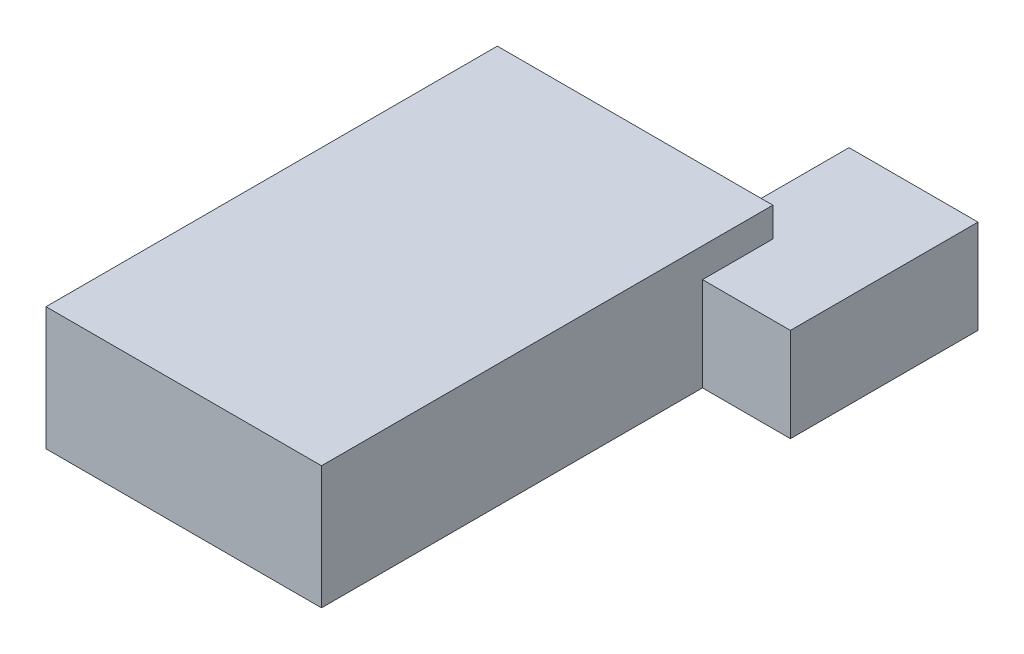
ISO-10303-21;
HEADER;
FILE_DESCRIPTION(('STEP AP214'),'2;1');
FILE_NAME('part.step','',(''),(''),'','','');
FILE_SCHEMA(('AUTOMOTIVE_DESIGN { 1 0 10303 214 1 1 1 1 }'));
ENDSEC;
DATA;
#1=APPLICATION_CONTEXT('core data for automotive mechanical design processes');
#2=APPLICATION_PROTOCOL_DEFINITION('international standard','automotive_design',2000,#1);
#3=PRODUCT_CONTEXT('',#1,'mechanical');
#4=PRODUCT('Part','Part','',(#3));
#5=PRODUCT_RELATED_PRODUCT_CATEGORY('part','',(#4));
#6=PRODUCT_DEFINITION_FORMATION('','',#4);
#7=PRODUCT_DEFINITION_CONTEXT('part definition',#1,'design');
#8=PRODUCT_DEFINITION('design','',#6,#7);
#9=PRODUCT_DEFINITION_SHAPE('','',#8);
#10=(LENGTH_UNIT() NAMED_UNIT(*) SI_UNIT(.MILLI.,.METRE.));
#11=(NAMED_UNIT(*) PLANE_ANGLE_UNIT() SI_UNIT($,.RADIAN.));
#12=(NAMED_UNIT(*) SI_UNIT($,.STERADIAN.) SOLID_ANGLE_UNIT());
#13=UNCERTAINTY_MEASURE_WITH_UNIT(LENGTH_MEASURE(1.E-05),#10,'distance_accuracy_value','');
#14=(GEOMETRIC_REPRESENTATION_CONTEXT(3) GLOBAL_UNCERTAINTY_ASSIGNED_CONTEXT((#13)) GLOBAL_UNIT_ASSIGNED_CONTEXT((#10,
#11,#12)) REPRESENTATION_CONTEXT('',''));
#15=CARTESIAN_POINT('',(0.,0.,0.));
#16=DIRECTION('',(0.,0.,1.));
#17=DIRECTION('',(1.,0.,0.));
#18=AXIS2_PLACEMENT_3D('',#15,#16,#17);
#19=CARTESIAN_POINT('',(4.44089209850063E-13,3000.,-5500.));
#20=DIRECTION('',(0.,1.,0.));
#21=DIRECTION('',(-1.,0.,0.));
#22=AXIS2_PLACEMENT_3D('',#19,#20,#21);
#23=PLANE('',#22);
#24=DIRECTION('',(1.,0.,0.));
#25=VECTOR('',#24,1.);
#26=CARTESIAN_POINT('',(4.44089209850063E-13,3000.,-5500.));
#27=LINE('',#26,#25);
#28=CARTESIAN_POINT('',(4700.,3000.,-5500.));
#29=VERTEX_POINT('',#28);
#30=CARTESIAN_POINT('',(7500.,3000.,-5500.));
#31=VERTEX_POINT('',#30);
#32=EDGE_CURVE('E250',#29,#31,#27,.T.);
#33=ORIENTED_EDGE('',*,*,#32,.F.);
#34=DIRECTION('',(0.,0.,-1.));
#35=VECTOR('',#34,1.);
#36=CARTESIAN_POINT('',(4700.00000000003,3000.,-2.08721928629531E-11));
#37=LINE('',#36,#35);
#38=CARTESIAN_POINT('',(4700.,3000.,-7700.));
#39=VERTEX_POINT('',#38);
#40=EDGE_CURVE('E62',#29,#39,#37,.T.);
#41=ORIENTED_EDGE('',*,*,#40,.T.);
#42=DIRECTION('',(-1.,0.,0.));
#43=VECTOR('',#42,1.);
#44=CARTESIAN_POINT('',(4.75041074259391E-13,3000.,-7700.));
#45=LINE('',#44,#43);
#46=CARTESIAN_POINT('',(3500.,3000.,-7700.));
#47=VERTEX_POINT('',#46);
#48=EDGE_CURVE('E222',#39,#47,#45,.T.);
#49=ORIENTED_EDGE('',*,*,#48,.T.);
#50=DIRECTION('',(0.,0.,-1.));
#51=VECTOR('',#50,1.);
#52=CARTESIAN_POINT('',(3500.,3000.,-5500.));
#53=LINE('',#52,#51);
#54=CARTESIAN_POINT('',(3500.,3000.,-11500.));
#55=VERTEX_POINT('',#54);
#56=EDGE_CURVE('E258',#47,#55,#53,.T.);
#57=ORIENTED_EDGE('',*,*,#56,.T.);
#58=DIRECTION('',(1.,0.,0.));
#59=VECTOR('',#58,1.);
#60=CARTESIAN_POINT('',(4.44089209850063E-13,3000.,-11500.));
#61=LINE('',#60,#59);
#62=CARTESIAN_POINT('',(7500.,3000.,-11500.));
#63=VERTEX_POINT('',#62);
#64=EDGE_CURVE('E241',#55,#63,#61,.T.);
#65=ORIENTED_EDGE('',*,*,#64,.T.);
#66=DIRECTION('',(0.,0.,-1.));
#67=VECTOR('',#66,1.);
#68=CARTESIAN_POINT('',(7500.,3000.,-5500.));
#69=LINE('',#68,#67);
#70=EDGE_CURVE('E257',#31,#63,#69,.T.);
#71=ORIENTED_EDGE('',*,*,#70,.F.);
#72=EDGE_LOOP('',(#33,#41,#49,#57,#65,#71));
#73=FACE_BOUND('',#72,.T.);
#74=ADVANCED_FACE('F37',(#73),#23,.F.);
#75=CARTESIAN_POINT('',(0.,0.,-5500.));
#76=DIRECTION('',(0.,0.,-1.));
#77=DIRECTION('',(-1.,0.,0.));
#78=AXIS2_PLACEMENT_3D('',#75,#76,#77);
#79=PLANE('',#78);
#80=DIRECTION('',(1.,0.,0.));
#81=VECTOR('',#80,1.);
#82=CARTESIAN_POINT('',(0.,0.,-5500.));
#83=LINE('',#82,#81);
#84=CARTESIAN_POINT('',(4700.,-5.75583995599256E-13,-5500.));
#85=VERTEX_POINT('',#84);
#86=CARTESIAN_POINT('',(7500.,0.,-5500.));
#87=VERTEX_POINT('',#86);
#88=EDGE_CURVE('E255',#85,#87,#83,.T.);
#89=ORIENTED_EDGE('',*,*,#88,.F.);
#90=DIRECTION('',(0.,1.,0.));
#91=VECTOR('',#90,1.);
#92=CARTESIAN_POINT('',(4700.,-1264.91106406735,-5500.));
#93=LINE('',#92,#91);
#94=EDGE_CURVE('E672',#85,#29,#93,.T.);
#95=ORIENTED_EDGE('',*,*,#94,.T.);
#96=ORIENTED_EDGE('',*,*,#32,.T.);
#97=DIRECTION('',(0.,-1.,0.));
#98=VECTOR('',#97,1.);
#99=CARTESIAN_POINT('',(7500.,0.,-5500.));
#100=LINE('',#99,#98);
#101=EDGE_CURVE('E252',#31,#87,#100,.T.);
#102=ORIENTED_EDGE('',*,*,#101,.T.);
#103=EDGE_LOOP('',(#89,#95,#96,#102));
#104=FACE_BOUND('',#103,.T.);
#105=ADVANCED_FACE('F403',(#104),#79,.T.);
#106=CARTESIAN_POINT('',(0.,0.,0.));
#107=DIRECTION('',(0.,-1.,0.));
#108=DIRECTION('',(0.,0.,-1.));
#109=AXIS2_PLACEMENT_3D('',#106,#107,#108);
#110=PLANE('',#109);
#111=DIRECTION('',(1.,0.,0.));
#112=VECTOR('',#111,1.);
#113=CARTESIAN_POINT('',(0.,0.,-11500.));
#114=LINE('',#113,#112);
#115=CARTESIAN_POINT('',(3500.,0.,-11500.));
#116=VERTEX_POINT('',#115);
#117=CARTESIAN_POINT('',(4500.,0.,-11500.));
#118=VERTEX_POINT('',#117);
#119=EDGE_CURVE('E239',#116,#118,#114,.T.);
#120=ORIENTED_EDGE('',*,*,#119,.F.);
#121=DIRECTION('',(0.,0.,-1.));
#122=VECTOR('',#121,1.);
#123=CARTESIAN_POINT('',(3500.,0.,-5500.));
#124=LINE('',#123,#122);
#125=CARTESIAN_POINT('',(3500.,0.,-7700.));
#126=VERTEX_POINT('',#125);
#127=EDGE_CURVE('E261',#126,#116,#124,.T.);
#128=ORIENTED_EDGE('',*,*,#127,.F.);
#129=DIRECTION('',(-1.,0.,0.));
#130=VECTOR('',#129,1.);
#131=CARTESIAN_POINT('',(-1.56292587248096E-13,0.,-7700.));
#132=LINE('',#131,#130);
#133=CARTESIAN_POINT('',(4700.,0.,-7700.));
#134=VERTEX_POINT('',#133);
#135=EDGE_CURVE('E233',#134,#126,#132,.T.);
#136=ORIENTED_EDGE('',*,*,#135,.F.);
#137=DIRECTION('',(0.,0.,-1.));
#138=VECTOR('',#137,1.);
#139=CARTESIAN_POINT('',(4700.00000000003,0.,-2.08721928629531E-11));
#140=LINE('',#139,#138);
#141=CARTESIAN_POINT('',(4700.,0.,-7300.));
#142=VERTEX_POINT('',#141);
#143=EDGE_CURVE('E232',#142,#134,#140,.T.);
#144=ORIENTED_EDGE('',*,*,#143,.F.);
#145=DIRECTION('',(1.,0.,0.));
#146=VECTOR('',#145,1.);
#147=CARTESIAN_POINT('',(3.22622197318064E-11,0.,-7300.00000000002));
#148=LINE('',#147,#146);
#149=CARTESIAN_POINT('',(4500.,0.,-7300.));
#150=VERTEX_POINT('',#149);
#151=EDGE_CURVE('E225',#150,#142,#148,.T.);
#152=ORIENTED_EDGE('',*,*,#151,.F.);
#153=DIRECTION('',(0.,0.,-1.));
#154=VECTOR('',#153,1.);
#155=CARTESIAN_POINT('',(4500.,0.,0.));
#156=LINE('',#155,#154);
#157=CARTESIAN_POINT('',(4500.,0.,-7500.));
#158=VERTEX_POINT('',#157);
#159=EDGE_CURVE('E221',#150,#158,#156,.T.);
#160=ORIENTED_EDGE('',*,*,#159,.T.);
#161=DIRECTION('',(-1.,0.,0.));
#162=VECTOR('',#161,1.);
#163=CARTESIAN_POINT('',(-4500.,0.,-7500.));
#164=LINE('',#163,#162);
#165=CARTESIAN_POINT('',(-4500.,0.,-7500.));
#166=VERTEX_POINT('',#165);
#167=EDGE_CURVE('E260',#158,#166,#164,.T.);
#168=ORIENTED_EDGE('',*,*,#167,.T.);
#169=DIRECTION('',(0.,0.,1.));
#170=VECTOR('',#169,1.);
#171=CARTESIAN_POINT('',(-4500.,0.,7500.));
#172=LINE('',#171,#170);
#173=CARTESIAN_POINT('',(-4500.,0.,7500.));
#174=VERTEX_POINT('',#173);
#175=EDGE_CURVE('E277',#166,#174,#172,.T.);
#176=ORIENTED_EDGE('',*,*,#175,.T.);
#177=DIRECTION('',(1.,0.,0.));
#178=VECTOR('',#177,1.);
#179=CARTESIAN_POINT('',(-4500.,0.,7500.));
#180=LINE('',#179,#178);
#181=CARTESIAN_POINT('',(4500.,0.,7500.));
#182=VERTEX_POINT('',#181);
#183=EDGE_CURVE('E268',#174,#182,#180,.T.);
#184=ORIENTED_EDGE('',*,*,#183,.T.);
#185=DIRECTION('',(0.,0.,-1.));
#186=VECTOR('',#185,1.);
#187=CARTESIAN_POINT('',(4500.,0.,129221.612979556));
#188=LINE('',#187,#186);
#189=CARTESIAN_POINT('',(4500.,0.,-6300.));
#190=VERTEX_POINT('',#189);
#191=EDGE_CURVE('E355',#182,#190,#188,.T.);
#192=ORIENTED_EDGE('',*,*,#191,.T.);
#193=DIRECTION('',(1.,0.,0.));
#194=VECTOR('',#193,1.);
#195=CARTESIAN_POINT('',(-1.56292587248096E-13,0.,-6300.));
#196=LINE('',#195,#194);
#197=CARTESIAN_POINT('',(4700.,0.,-6300.));
#198=VERTEX_POINT('',#197);
#199=EDGE_CURVE('E660',#190,#198,#196,.T.);
#200=ORIENTED_EDGE('',*,*,#199,.T.);
#201=DIRECTION('',(0.,0.,1.));
#202=VECTOR('',#201,1.);
#203=CARTESIAN_POINT('',(4699.99999999999,0.,5.21804821573824E-12));
#204=LINE('',#203,#202);
#205=EDGE_CURVE('E54',#198,#85,#204,.T.);
#206=ORIENTED_EDGE('',*,*,#205,.T.);
#207=ORIENTED_EDGE('',*,*,#88,.T.);
#208=DIRECTION('',(0.,0.,-1.));
#209=VECTOR('',#208,1.);
#210=CARTESIAN_POINT('',(7500.,0.,129221.612979556));
#211=LINE('',#210,#209);
#212=CARTESIAN_POINT('',(7500.,0.,-11500.));
#213=VERTEX_POINT('',#212);
#214=EDGE_CURVE('E234',#87,#213,#211,.T.);
#215=ORIENTED_EDGE('',*,*,#214,.T.);
#216=DIRECTION('',(1.,0.,0.));
#217=VECTOR('',#216,1.);
#218=CARTESIAN_POINT('',(0.,0.,-11500.));
#219=LINE('',#218,#217);
#220=EDGE_CURVE('E237',#118,#213,#219,.T.);
#221=ORIENTED_EDGE('',*,*,#220,.F.);
#222=EDGE_LOOP('',(#120,#128,#136,#144,#152,#160,#168,#176,#184,#192,#200,#206,#207,#215,#221));
#223=FACE_BOUND('',#222,.T.);
#224=DIRECTION('',(1.,0.,0.));
#225=VECTOR('',#224,1.);
#226=CARTESIAN_POINT('',(0.,0.,-11700.));
#227=LINE('',#226,#225);
#228=CARTESIAN_POINT('',(4500.,0.,-11700.));
#229=VERTEX_POINT('',#228);
#230=CARTESIAN_POINT('',(7700.,0.,-11700.));
#231=VERTEX_POINT('',#230);
#232=EDGE_CURVE('E350',#229,#231,#227,.T.);
#233=ORIENTED_EDGE('',*,*,#232,.T.);
#234=DIRECTION('',(0.,0.,-1.));
#235=VECTOR('',#234,1.);
#236=CARTESIAN_POINT('',(7700.,0.,129221.612979556));
#237=LINE('',#236,#235);
#238=CARTESIAN_POINT('',(7700.,0.,-5300.));
#239=VERTEX_POINT('',#238);
#240=EDGE_CURVE('E352',#239,#231,#237,.T.);
#241=ORIENTED_EDGE('',*,*,#240,.F.);
#242=DIRECTION('',(1.,0.,0.));
#243=VECTOR('',#242,1.);
#244=CARTESIAN_POINT('',(0.,0.,-5300.));
#245=LINE('',#244,#243);
#246=CARTESIAN_POINT('',(4700.,0.,-5300.));
#247=VERTEX_POINT('',#246);
#248=EDGE_CURVE('E328',#247,#239,#245,.T.);
#249=ORIENTED_EDGE('',*,*,#248,.F.);
#250=DIRECTION('',(0.,0.,-1.));
#251=VECTOR('',#250,1.);
#252=CARTESIAN_POINT('',(4700.,0.,0.));
#253=LINE('',#252,#251);
#254=CARTESIAN_POINT('',(4700.,0.,7700.));
#255=VERTEX_POINT('',#254);
#256=EDGE_CURVE('E297',#255,#247,#253,.T.);
#257=ORIENTED_EDGE('',*,*,#256,.F.);
#258=DIRECTION('',(1.,0.,0.));
#259=VECTOR('',#258,1.);
#260=CARTESIAN_POINT('',(0.,0.,7700.));
#261=LINE('',#260,#259);
#262=CARTESIAN_POINT('',(-4700.,0.,7700.));
#263=VERTEX_POINT('',#262);
#264=EDGE_CURVE('E305',#263,#255,#261,.T.);
#265=ORIENTED_EDGE('',*,*,#264,.F.);
#266=DIRECTION('',(0.,0.,1.));
#267=VECTOR('',#266,1.);
#268=CARTESIAN_POINT('',(-4700.,0.,0.));
#269=LINE('',#268,#267);
#270=CARTESIAN_POINT('',(-4700.,0.,-7700.));
#271=VERTEX_POINT('',#270);
#272=EDGE_CURVE('E344',#271,#263,#269,.T.);
#273=ORIENTED_EDGE('',*,*,#272,.F.);
#274=DIRECTION('',(-1.,0.,0.));
#275=VECTOR('',#274,1.);
#276=CARTESIAN_POINT('',(0.,0.,-7700.));
#277=LINE('',#276,#275);
#278=CARTESIAN_POINT('',(3300.,0.,-7700.));
#279=VERTEX_POINT('',#278);
#280=EDGE_CURVE('E342',#279,#271,#277,.T.);
#281=ORIENTED_EDGE('',*,*,#280,.F.);
#282=DIRECTION('',(0.,0.,-1.));
#283=VECTOR('',#282,1.);
#284=CARTESIAN_POINT('',(3300.,0.,0.));
#285=LINE('',#284,#283);
#286=CARTESIAN_POINT('',(3300.,0.,-11700.));
#287=VERTEX_POINT('',#286);
#288=EDGE_CURVE('E327',#279,#287,#285,.T.);
#289=ORIENTED_EDGE('',*,*,#288,.T.);
#290=DIRECTION('',(1.,0.,0.));
#291=VECTOR('',#290,1.);
#292=CARTESIAN_POINT('',(0.,0.,-11700.));
#293=LINE('',#292,#291);
#294=EDGE_CURVE('E333',#287,#229,#293,.T.);
#295=ORIENTED_EDGE('',*,*,#294,.T.);
#296=EDGE_LOOP('',(#233,#241,#249,#257,#265,#273,#281,#289,#295));
#297=FACE_BOUND('',#296,.T.);
#298=ADVANCED_FACE('F362',(#223,#297),#110,.T.);
#299=CARTESIAN_POINT('',(4700.,4000.,7500.));
#300=DIRECTION('',(-1.,0.,0.));
#301=DIRECTION('',(0.,0.,1.));
#302=AXIS2_PLACEMENT_3D('',#299,#300,#301);
#303=PLANE('',#302);
#304=DIRECTION('',(0.,-1.,0.));
#305=VECTOR('',#304,1.);
#306=CARTESIAN_POINT('',(4700.,4000.,-5300.));
#307=LINE('',#306,#305);
#308=CARTESIAN_POINT('',(4700.,3200.,-5300.));
#309=VERTEX_POINT('',#308);
#310=EDGE_CURVE('E290',#309,#247,#307,.T.);
#311=ORIENTED_EDGE('',*,*,#310,.F.);
#312=DIRECTION('',(0.,0.,-1.));
#313=VECTOR('',#312,1.);
#314=CARTESIAN_POINT('',(4700.,3200.,7500.));
#315=LINE('',#314,#313);
#316=CARTESIAN_POINT('',(4700.,3200.,-7700.));
#317=VERTEX_POINT('',#316);
#318=EDGE_CURVE('E295',#309,#317,#315,.T.);
#319=ORIENTED_EDGE('',*,*,#318,.T.);
#320=DIRECTION('',(0.,-1.,0.));
#321=VECTOR('',#320,1.);
#322=CARTESIAN_POINT('',(4700.,4000.,-7700.));
#323=LINE('',#322,#321);
#324=CARTESIAN_POINT('',(4700.,4200.,-7700.));
#325=VERTEX_POINT('',#324);
#326=EDGE_CURVE('E46',#325,#317,#323,.T.);
#327=ORIENTED_EDGE('',*,*,#326,.F.);
#328=DIRECTION('',(0.,0.,-1.));
#329=VECTOR('',#328,1.);
#330=CARTESIAN_POINT('',(4700.,4200.,0.));
#331=LINE('',#330,#329);
#332=CARTESIAN_POINT('',(4700.,4200.,7700.));
#333=VERTEX_POINT('',#332);
#334=EDGE_CURVE('E301',#333,#325,#331,.T.);
#335=ORIENTED_EDGE('',*,*,#334,.F.);
#336=DIRECTION('',(0.,-1.,0.));
#337=VECTOR('',#336,1.);
#338=CARTESIAN_POINT('',(4700.,4000.,7700.));
#339=LINE('',#338,#337);
#340=EDGE_CURVE('E306',#333,#255,#339,.T.);
#341=ORIENTED_EDGE('',*,*,#340,.T.);
#342=ORIENTED_EDGE('',*,*,#256,.T.);
#343=EDGE_LOOP('',(#311,#319,#327,#335,#341,#342));
#344=FACE_BOUND('',#343,.T.);
#345=ADVANCED_FACE('F382',(#344),#303,.F.);
#346=CARTESIAN_POINT('',(-4500.,4000.,-7700.));
#347=DIRECTION('',(0.,0.,1.));
#348=DIRECTION('',(1.,0.,0.));
#349=AXIS2_PLACEMENT_3D('',#346,#347,#348);
#350=PLANE('',#349);
#351=ORIENTED_EDGE('',*,*,#326,.T.);
#352=DIRECTION('',(-1.,0.,0.));
#353=VECTOR('',#352,1.);
#354=CARTESIAN_POINT('',(-4500.,3200.,-7700.));
#355=LINE('',#354,#353);
#356=CARTESIAN_POINT('',(3300.,3200.,-7700.));
#357=VERTEX_POINT('',#356);
#358=EDGE_CURVE('E11',#317,#357,#355,.T.);
#359=ORIENTED_EDGE('',*,*,#358,.T.);
#360=DIRECTION('',(0.,-1.,0.));
#361=VECTOR('',#360,1.);
#362=CARTESIAN_POINT('',(3300.,4000.,-7700.));
#363=LINE('',#362,#361);
#364=EDGE_CURVE('E293',#357,#279,#363,.T.);
#365=ORIENTED_EDGE('',*,*,#364,.T.);
#366=ORIENTED_EDGE('',*,*,#280,.T.);
#367=DIRECTION('',(0.,-1.,0.));
#368=VECTOR('',#367,1.);
#369=CARTESIAN_POINT('',(-4700.,4000.,-7700.));
#370=LINE('',#369,#368);
#371=CARTESIAN_POINT('',(-4700.,4200.,-7700.));
#372=VERTEX_POINT('',#371);
#373=EDGE_CURVE('E300',#372,#271,#370,.T.);
#374=ORIENTED_EDGE('',*,*,#373,.F.);
#375=DIRECTION('',(-1.,0.,0.));
#376=VECTOR('',#375,1.);
#377=CARTESIAN_POINT('',(0.,4200.,-7700.));
#378=LINE('',#377,#376);
#379=EDGE_CURVE('E304',#325,#372,#378,.T.);
#380=ORIENTED_EDGE('',*,*,#379,.F.);
#381=EDGE_LOOP('',(#351,#359,#365,#366,#374,#380));
#382=FACE_BOUND('',#381,.T.);
#383=ADVANCED_FACE('F390',(#382),#350,.F.);
#384=CARTESIAN_POINT('',(-4700.,4000.,7500.));
#385=DIRECTION('',(1.,0.,0.));
#386=DIRECTION('',(0.,0.,-1.));
#387=AXIS2_PLACEMENT_3D('',#384,#385,#386);
#388=PLANE('',#387);
#389=ORIENTED_EDGE('',*,*,#272,.T.);
#390=DIRECTION('',(0.,-1.,0.));
#391=VECTOR('',#390,1.);
#392=CARTESIAN_POINT('',(-4700.,4000.,7700.));
#393=LINE('',#392,#391);
#394=CARTESIAN_POINT('',(-4700.,4200.,7700.));
#395=VERTEX_POINT('',#394);
#396=EDGE_CURVE('E308',#395,#263,#393,.T.);
#397=ORIENTED_EDGE('',*,*,#396,.F.);
#398=DIRECTION('',(0.,0.,1.));
#399=VECTOR('',#398,1.);
#400=CARTESIAN_POINT('',(-4700.,4200.,0.));
#401=LINE('',#400,#399);
#402=EDGE_CURVE('E316',#372,#395,#401,.T.);
#403=ORIENTED_EDGE('',*,*,#402,.F.);
#404=ORIENTED_EDGE('',*,*,#373,.T.);
#405=EDGE_LOOP('',(#389,#397,#403,#404));
#406=FACE_BOUND('',#405,.T.);
#407=ADVANCED_FACE('F441',(#406),#388,.F.);
#408=CARTESIAN_POINT('',(-4500.,4000.,7700.));
#409=DIRECTION('',(0.,0.,-1.));
#410=DIRECTION('',(-1.,0.,0.));
#411=AXIS2_PLACEMENT_3D('',#408,#409,#410);
#412=PLANE('',#411);
#413=ORIENTED_EDGE('',*,*,#264,.T.);
#414=ORIENTED_EDGE('',*,*,#340,.F.);
#415=DIRECTION('',(1.,0.,0.));
#416=VECTOR('',#415,1.);
#417=CARTESIAN_POINT('',(0.,4200.,7700.));
#418=LINE('',#417,#416);
#419=EDGE_CURVE('E309',#395,#333,#418,.T.);
#420=ORIENTED_EDGE('',*,*,#419,.F.);
#421=ORIENTED_EDGE('',*,*,#396,.T.);
#422=EDGE_LOOP('',(#413,#414,#420,#421));
#423=FACE_BOUND('',#422,.T.);
#424=ADVANCED_FACE('F444',(#423),#412,.F.);
#425=CARTESIAN_POINT('',(0.,4200.,0.));
#426=DIRECTION('',(0.,-1.,0.));
#427=DIRECTION('',(0.,0.,-1.));
#428=AXIS2_PLACEMENT_3D('',#425,#426,#427);
#429=PLANE('',#428);
#430=ORIENTED_EDGE('',*,*,#334,.T.);
#431=ORIENTED_EDGE('',*,*,#379,.T.);
#432=ORIENTED_EDGE('',*,*,#402,.T.);
#433=ORIENTED_EDGE('',*,*,#419,.T.);
#434=EDGE_LOOP('',(#430,#431,#432,#433));
#435=FACE_BOUND('',#434,.T.);
#436=ADVANCED_FACE('F400',(#435),#429,.F.);
#437=CARTESIAN_POINT('',(4.736951571734E-13,3200.,-5500.));
#438=DIRECTION('',(0.,1.,0.));
#439=DIRECTION('',(-1.,0.,0.));
#440=AXIS2_PLACEMENT_3D('',#437,#438,#439);
#441=PLANE('',#440);
#442=ORIENTED_EDGE('',*,*,#318,.F.);
#443=DIRECTION('',(1.,0.,0.));
#444=VECTOR('',#443,1.);
#445=CARTESIAN_POINT('',(4.736951571734E-13,3200.,-5300.));
#446=LINE('',#445,#444);
#447=CARTESIAN_POINT('',(7700.,3200.,-5300.));
#448=VERTEX_POINT('',#447);
#449=EDGE_CURVE('E321',#309,#448,#446,.T.);
#450=ORIENTED_EDGE('',*,*,#449,.T.);
#451=DIRECTION('',(0.,0.,-1.));
#452=VECTOR('',#451,1.);
#453=CARTESIAN_POINT('',(7700.,3200.,-5500.));
#454=LINE('',#453,#452);
#455=CARTESIAN_POINT('',(7700.,3200.,-11700.));
#456=VERTEX_POINT('',#455);
#457=EDGE_CURVE('E325',#448,#456,#454,.T.);
#458=ORIENTED_EDGE('',*,*,#457,.T.);
#459=DIRECTION('',(1.,0.,0.));
#460=VECTOR('',#459,1.);
#461=CARTESIAN_POINT('',(4.736951571734E-13,3200.,-11700.));
#462=LINE('',#461,#460);
#463=CARTESIAN_POINT('',(3300.,3200.,-11700.));
#464=VERTEX_POINT('',#463);
#465=EDGE_CURVE('E329',#464,#456,#462,.T.);
#466=ORIENTED_EDGE('',*,*,#465,.F.);
#467=DIRECTION('',(0.,0.,-1.));
#468=VECTOR('',#467,1.);
#469=CARTESIAN_POINT('',(3300.,3200.,-5500.));
#470=LINE('',#469,#468);
#471=EDGE_CURVE('E294',#357,#464,#470,.T.);
#472=ORIENTED_EDGE('',*,*,#471,.F.);
#473=ORIENTED_EDGE('',*,*,#358,.F.);
#474=EDGE_LOOP('',(#442,#450,#458,#466,#472,#473));
#475=FACE_BOUND('',#474,.T.);
#476=ADVANCED_FACE('F386',(#475),#441,.T.);
#477=CARTESIAN_POINT('',(3300.,0.,-5500.));
#478=DIRECTION('',(-1.,0.,0.));
#479=DIRECTION('',(0.,0.,1.));
#480=AXIS2_PLACEMENT_3D('',#477,#478,#479);
#481=PLANE('',#480);
#482=ORIENTED_EDGE('',*,*,#364,.F.);
#483=ORIENTED_EDGE('',*,*,#471,.T.);
#484=DIRECTION('',(0.,1.,0.));
#485=VECTOR('',#484,1.);
#486=CARTESIAN_POINT('',(3300.,0.,-11700.));
#487=LINE('',#486,#485);
#488=EDGE_CURVE('E324',#287,#464,#487,.T.);
#489=ORIENTED_EDGE('',*,*,#488,.F.);
#490=ORIENTED_EDGE('',*,*,#288,.F.);
#491=EDGE_LOOP('',(#482,#483,#489,#490));
#492=FACE_BOUND('',#491,.T.);
#493=ADVANCED_FACE('F392',(#492),#481,.T.);
#494=CARTESIAN_POINT('',(0.,0.,-5300.));
#495=DIRECTION('',(0.,0.,-1.));
#496=DIRECTION('',(-1.,0.,0.));
#497=AXIS2_PLACEMENT_3D('',#494,#495,#496);
#498=PLANE('',#497);
#499=ORIENTED_EDGE('',*,*,#449,.F.);
#500=ORIENTED_EDGE('',*,*,#310,.T.);
#501=ORIENTED_EDGE('',*,*,#248,.T.);
#502=DIRECTION('',(0.,-1.,0.));
#503=VECTOR('',#502,1.);
#504=CARTESIAN_POINT('',(7700.,0.,-5300.));
#505=LINE('',#504,#503);
#506=EDGE_CURVE('E323',#448,#239,#505,.T.);
#507=ORIENTED_EDGE('',*,*,#506,.F.);
#508=EDGE_LOOP('',(#499,#500,#501,#507));
#509=FACE_BOUND('',#508,.T.);
#510=ADVANCED_FACE('F379',(#509),#498,.F.);
#511=CARTESIAN_POINT('',(7700.,0.,-5500.));
#512=DIRECTION('',(1.,0.,0.));
#513=DIRECTION('',(0.,0.,-1.));
#514=AXIS2_PLACEMENT_3D('',#511,#512,#513);
#515=PLANE('',#514);
#516=ORIENTED_EDGE('',*,*,#240,.T.);
#517=DIRECTION('',(0.,-1.,0.));
#518=VECTOR('',#517,1.);
#519=CARTESIAN_POINT('',(7700.,0.,-11700.));
#520=LINE('',#519,#518);
#521=EDGE_CURVE('E332',#456,#231,#520,.T.);
#522=ORIENTED_EDGE('',*,*,#521,.F.);
#523=ORIENTED_EDGE('',*,*,#457,.F.);
#524=ORIENTED_EDGE('',*,*,#506,.T.);
#525=EDGE_LOOP('',(#516,#522,#523,#524));
#526=FACE_BOUND('',#525,.T.);
#527=ADVANCED_FACE('F373',(#526),#515,.T.);
#528=CARTESIAN_POINT('',(0.,0.,-11700.));
#529=DIRECTION('',(0.,0.,-1.));
#530=DIRECTION('',(-1.,0.,0.));
#531=AXIS2_PLACEMENT_3D('',#528,#529,#530);
#532=PLANE('',#531);
#533=ORIENTED_EDGE('',*,*,#294,.F.);
#534=ORIENTED_EDGE('',*,*,#488,.T.);
#535=ORIENTED_EDGE('',*,*,#465,.T.);
#536=ORIENTED_EDGE('',*,*,#521,.T.);
#537=ORIENTED_EDGE('',*,*,#232,.F.);
#538=EDGE_LOOP('',(#533,#534,#535,#536,#537));
#539=FACE_BOUND('',#538,.T.);
#540=ADVANCED_FACE('F39',(#539),#532,.T.);
#541=CARTESIAN_POINT('',(4500.,4000.,7500.));
#542=DIRECTION('',(-1.,0.,0.));
#543=DIRECTION('',(0.,0.,1.));
#544=AXIS2_PLACEMENT_3D('',#541,#542,#543);
#545=PLANE('',#544);
#546=DIRECTION('',(0.,1.,0.));
#547=VECTOR('',#546,1.);
#548=CARTESIAN_POINT('',(4500.,-1264.91106406735,-7300.));
#549=LINE('',#548,#547);
#550=CARTESIAN_POINT('',(4500.,2300.,-7300.));
#551=VERTEX_POINT('',#550);
#552=EDGE_CURVE('E214',#150,#551,#549,.T.);
#553=ORIENTED_EDGE('',*,*,#552,.T.);
#554=DIRECTION('',(0.,0.,1.));
#555=VECTOR('',#554,1.);
#556=CARTESIAN_POINT('',(4500.,2300.,-7300.));
#557=LINE('',#556,#555);
#558=CARTESIAN_POINT('',(4500.,2300.,-6300.));
#559=VERTEX_POINT('',#558);
#560=EDGE_CURVE('E199',#551,#559,#557,.T.);
#561=ORIENTED_EDGE('',*,*,#560,.T.);
#562=DIRECTION('',(0.,1.,0.));
#563=VECTOR('',#562,1.);
#564=CARTESIAN_POINT('',(4500.,-1264.91106406735,-6300.));
#565=LINE('',#564,#563);
#566=EDGE_CURVE('E668',#190,#559,#565,.T.);
#567=ORIENTED_EDGE('',*,*,#566,.F.);
#568=ORIENTED_EDGE('',*,*,#191,.F.);
#569=DIRECTION('',(0.,-1.,0.));
#570=VECTOR('',#569,1.);
#571=CARTESIAN_POINT('',(4500.,4000.,7500.));
#572=LINE('',#571,#570);
#573=CARTESIAN_POINT('',(4500.,4000.,7500.));
#574=VERTEX_POINT('',#573);
#575=EDGE_CURVE('E274',#574,#182,#572,.T.);
#576=ORIENTED_EDGE('',*,*,#575,.F.);
#577=DIRECTION('',(0.,0.,-1.));
#578=VECTOR('',#577,1.);
#579=CARTESIAN_POINT('',(4500.,4000.,7500.));
#580=LINE('',#579,#578);
#581=CARTESIAN_POINT('',(4500.,4000.,-7500.));
#582=VERTEX_POINT('',#581);
#583=EDGE_CURVE('E264',#574,#582,#580,.T.);
#584=ORIENTED_EDGE('',*,*,#583,.T.);
#585=DIRECTION('',(0.,-1.,0.));
#586=VECTOR('',#585,1.);
#587=CARTESIAN_POINT('',(4500.,4000.,-7500.));
#588=LINE('',#587,#586);
#589=EDGE_CURVE('E288',#582,#158,#588,.T.);
#590=ORIENTED_EDGE('',*,*,#589,.T.);
#591=ORIENTED_EDGE('',*,*,#159,.F.);
#592=EDGE_LOOP('',(#553,#561,#567,#568,#576,#584,#590,#591));
#593=FACE_BOUND('',#592,.T.);
#594=ADVANCED_FACE('F219',(#593),#545,.T.);
#595=CARTESIAN_POINT('',(-4500.,4000.,-7500.));
#596=DIRECTION('',(0.,0.,1.));
#597=DIRECTION('',(1.,0.,0.));
#598=AXIS2_PLACEMENT_3D('',#595,#596,#597);
#599=PLANE('',#598);
#600=ORIENTED_EDGE('',*,*,#589,.F.);
#601=DIRECTION('',(-1.,0.,0.));
#602=VECTOR('',#601,1.);
#603=CARTESIAN_POINT('',(-4500.,4000.,-7500.));
#604=LINE('',#603,#602);
#605=CARTESIAN_POINT('',(-4500.,4000.,-7500.));
#606=VERTEX_POINT('',#605);
#607=EDGE_CURVE('E267',#582,#606,#604,.T.);
#608=ORIENTED_EDGE('',*,*,#607,.T.);
#609=DIRECTION('',(0.,-1.,0.));
#610=VECTOR('',#609,1.);
#611=CARTESIAN_POINT('',(-4500.,4000.,-7500.));
#612=LINE('',#611,#610);
#613=EDGE_CURVE('E286',#606,#166,#612,.T.);
#614=ORIENTED_EDGE('',*,*,#613,.T.);
#615=ORIENTED_EDGE('',*,*,#167,.F.);
#616=EDGE_LOOP('',(#600,#608,#614,#615));
#617=FACE_BOUND('',#616,.T.);
#618=ADVANCED_FACE('F428',(#617),#599,.T.);
#619=CARTESIAN_POINT('',(-4500.,4000.,7500.));
#620=DIRECTION('',(1.,0.,0.));
#621=DIRECTION('',(0.,0.,-1.));
#622=AXIS2_PLACEMENT_3D('',#619,#620,#621);
#623=PLANE('',#622);
#624=ORIENTED_EDGE('',*,*,#175,.F.);
#625=ORIENTED_EDGE('',*,*,#613,.F.);
#626=DIRECTION('',(0.,0.,1.));
#627=VECTOR('',#626,1.);
#628=CARTESIAN_POINT('',(-4500.,4000.,7500.));
#629=LINE('',#628,#627);
#630=CARTESIAN_POINT('',(-4500.,4000.,7500.));
#631=VERTEX_POINT('',#630);
#632=EDGE_CURVE('E270',#606,#631,#629,.T.);
#633=ORIENTED_EDGE('',*,*,#632,.T.);
#634=DIRECTION('',(0.,-1.,0.));
#635=VECTOR('',#634,1.);
#636=CARTESIAN_POINT('',(-4500.,4000.,7500.));
#637=LINE('',#636,#635);
#638=EDGE_CURVE('E284',#631,#174,#637,.T.);
#639=ORIENTED_EDGE('',*,*,#638,.T.);
#640=EDGE_LOOP('',(#624,#625,#633,#639));
#641=FACE_BOUND('',#640,.T.);
#642=ADVANCED_FACE('F424',(#641),#623,.T.);
#643=CARTESIAN_POINT('',(-4500.,4000.,7500.));
#644=DIRECTION('',(0.,0.,-1.));
#645=DIRECTION('',(-1.,0.,0.));
#646=AXIS2_PLACEMENT_3D('',#643,#644,#645);
#647=PLANE('',#646);
#648=ORIENTED_EDGE('',*,*,#183,.F.);
#649=ORIENTED_EDGE('',*,*,#638,.F.);
#650=DIRECTION('',(1.,0.,0.));
#651=VECTOR('',#650,1.);
#652=CARTESIAN_POINT('',(-4500.,4000.,7500.));
#653=LINE('',#652,#651);
#654=EDGE_CURVE('E272',#631,#574,#653,.T.);
#655=ORIENTED_EDGE('',*,*,#654,.T.);
#656=ORIENTED_EDGE('',*,*,#575,.T.);
#657=EDGE_LOOP('',(#648,#649,#655,#656));
#658=FACE_BOUND('',#657,.T.);
#659=ADVANCED_FACE('F420',(#658),#647,.T.);
#660=CARTESIAN_POINT('',(0.,4000.,0.));
#661=DIRECTION('',(0.,-1.,0.));
#662=DIRECTION('',(0.,0.,-1.));
#663=AXIS2_PLACEMENT_3D('',#660,#661,#662);
#664=PLANE('',#663);
#665=ORIENTED_EDGE('',*,*,#583,.F.);
#666=ORIENTED_EDGE('',*,*,#654,.F.);
#667=ORIENTED_EDGE('',*,*,#632,.F.);
#668=ORIENTED_EDGE('',*,*,#607,.F.);
#669=EDGE_LOOP('',(#665,#666,#667,#668));
#670=FACE_BOUND('',#669,.T.);
#671=ADVANCED_FACE('F416',(#670),#664,.T.);
#672=CARTESIAN_POINT('',(3500.,0.,-5500.));
#673=DIRECTION('',(-1.,0.,0.));
#674=DIRECTION('',(0.,0.,1.));
#675=AXIS2_PLACEMENT_3D('',#672,#673,#674);
#676=PLANE('',#675);
#677=ORIENTED_EDGE('',*,*,#56,.F.);
#678=DIRECTION('',(0.,1.,0.));
#679=VECTOR('',#678,1.);
#680=CARTESIAN_POINT('',(3500.,-1264.91106406735,-7700.));
#681=LINE('',#680,#679);
#682=EDGE_CURVE('E229',#126,#47,#681,.T.);
#683=ORIENTED_EDGE('',*,*,#682,.F.);
#684=ORIENTED_EDGE('',*,*,#127,.T.);
#685=DIRECTION('',(0.,1.,0.));
#686=VECTOR('',#685,1.);
#687=CARTESIAN_POINT('',(3500.,0.,-11500.));
#688=LINE('',#687,#686);
#689=EDGE_CURVE('E247',#116,#55,#688,.T.);
#690=ORIENTED_EDGE('',*,*,#689,.T.);
#691=EDGE_LOOP('',(#677,#683,#684,#690));
#692=FACE_BOUND('',#691,.T.);
#693=ADVANCED_FACE('F419',(#692),#676,.F.);
#694=CARTESIAN_POINT('',(7500.,0.,-5500.));
#695=DIRECTION('',(1.,0.,0.));
#696=DIRECTION('',(0.,0.,-1.));
#697=AXIS2_PLACEMENT_3D('',#694,#695,#696);
#698=PLANE('',#697);
#699=ORIENTED_EDGE('',*,*,#214,.F.);
#700=ORIENTED_EDGE('',*,*,#101,.F.);
#701=ORIENTED_EDGE('',*,*,#70,.T.);
#702=DIRECTION('',(0.,-1.,0.));
#703=VECTOR('',#702,1.);
#704=CARTESIAN_POINT('',(7500.,0.,-11500.));
#705=LINE('',#704,#703);
#706=EDGE_CURVE('E244',#63,#213,#705,.T.);
#707=ORIENTED_EDGE('',*,*,#706,.T.);
#708=EDGE_LOOP('',(#699,#700,#701,#707));
#709=FACE_BOUND('',#708,.T.);
#710=ADVANCED_FACE('F414',(#709),#698,.F.);
#711=CARTESIAN_POINT('',(0.,0.,-11500.));
#712=DIRECTION('',(0.,0.,-1.));
#713=DIRECTION('',(-1.,0.,0.));
#714=AXIS2_PLACEMENT_3D('',#711,#712,#713);
#715=PLANE('',#714);
#716=ORIENTED_EDGE('',*,*,#119,.T.);
#717=ORIENTED_EDGE('',*,*,#220,.T.);
#718=ORIENTED_EDGE('',*,*,#706,.F.);
#719=ORIENTED_EDGE('',*,*,#64,.F.);
#720=ORIENTED_EDGE('',*,*,#689,.F.);
#721=EDGE_LOOP('',(#716,#717,#718,#719,#720));
#722=FACE_BOUND('',#721,.T.);
#723=ADVANCED_FACE('F585',(#722),#715,.F.);
#724=CARTESIAN_POINT('',(-1.56292587248096E-13,-1264.91106406735,-7700.));
#725=DIRECTION('',(0.,0.,-1.));
#726=DIRECTION('',(-1.,0.,0.));
#727=AXIS2_PLACEMENT_3D('',#724,#725,#726);
#728=PLANE('',#727);
#729=DIRECTION('',(0.,1.,0.));
#730=VECTOR('',#729,1.);
#731=CARTESIAN_POINT('',(4700.,-1264.91106406735,-7700.));
#732=LINE('',#731,#730);
#733=EDGE_CURVE('E657',#134,#39,#732,.T.);
#734=ORIENTED_EDGE('',*,*,#733,.F.);
#735=ORIENTED_EDGE('',*,*,#135,.T.);
#736=ORIENTED_EDGE('',*,*,#682,.T.);
#737=ORIENTED_EDGE('',*,*,#48,.F.);
#738=EDGE_LOOP('',(#734,#735,#736,#737));
#739=FACE_BOUND('',#738,.T.);
#740=ADVANCED_FACE('F579',(#739),#728,.T.);
#741=CARTESIAN_POINT('',(4700.00000000003,-1264.91106406735,-2.08721928629531E-11));
#742=DIRECTION('',(1.,0.,0.));
#743=DIRECTION('',(0.,0.,-1.));
#744=AXIS2_PLACEMENT_3D('',#741,#742,#743);
#745=PLANE('',#744);
#746=DIRECTION('',(0.,1.,0.));
#747=VECTOR('',#746,1.);
#748=CARTESIAN_POINT('',(4700.,-1264.91106406735,-7300.));
#749=LINE('',#748,#747);
#750=CARTESIAN_POINT('',(4700.,2300.,-7300.));
#751=VERTEX_POINT('',#750);
#752=EDGE_CURVE('E217',#142,#751,#749,.T.);
#753=ORIENTED_EDGE('',*,*,#752,.F.);
#754=ORIENTED_EDGE('',*,*,#143,.T.);
#755=ORIENTED_EDGE('',*,*,#733,.T.);
#756=ORIENTED_EDGE('',*,*,#40,.F.);
#757=ORIENTED_EDGE('',*,*,#94,.F.);
#758=ORIENTED_EDGE('',*,*,#205,.F.);
#759=DIRECTION('',(0.,1.,0.));
#760=VECTOR('',#759,1.);
#761=CARTESIAN_POINT('',(4700.,-1264.91106406735,-6300.));
#762=LINE('',#761,#760);
#763=CARTESIAN_POINT('',(4700.,2300.,-6300.));
#764=VERTEX_POINT('',#763);
#765=EDGE_CURVE('E670',#198,#764,#762,.T.);
#766=ORIENTED_EDGE('',*,*,#765,.T.);
#767=DIRECTION('',(0.,0.,-1.));
#768=VECTOR('',#767,1.);
#769=CARTESIAN_POINT('',(4700.,2300.,-7300.));
#770=LINE('',#769,#768);
#771=EDGE_CURVE('E671',#764,#751,#770,.T.);
#772=ORIENTED_EDGE('',*,*,#771,.T.);
#773=EDGE_LOOP('',(#753,#754,#755,#756,#757,#758,#766,#772));
#774=FACE_BOUND('',#773,.T.);
#775=ADVANCED_FACE('F584',(#774),#745,.T.);
#776=CARTESIAN_POINT('',(3.22622197318064E-11,-1264.91106406735,-7300.00000000002));
#777=DIRECTION('',(0.,0.,1.));
#778=DIRECTION('',(1.,0.,0.));
#779=AXIS2_PLACEMENT_3D('',#776,#777,#778);
#780=PLANE('',#779);
#781=DIRECTION('',(-1.,0.,0.));
#782=VECTOR('',#781,1.);
#783=CARTESIAN_POINT('',(5920.65556157337,2300.,-7300.));
#784=LINE('',#783,#782);
#785=EDGE_CURVE('E202',#751,#551,#784,.T.);
#786=ORIENTED_EDGE('',*,*,#785,.T.);
#787=ORIENTED_EDGE('',*,*,#552,.F.);
#788=ORIENTED_EDGE('',*,*,#151,.T.);
#789=ORIENTED_EDGE('',*,*,#752,.T.);
#790=EDGE_LOOP('',(#786,#787,#788,#789));
#791=FACE_BOUND('',#790,.T.);
#792=ADVANCED_FACE('F213',(#791),#780,.T.);
#793=CARTESIAN_POINT('',(-1.56292587248096E-13,-1264.91106406735,-6300.));
#794=DIRECTION('',(0.,0.,1.));
#795=DIRECTION('',(1.,0.,0.));
#796=AXIS2_PLACEMENT_3D('',#793,#794,#795);
#797=PLANE('',#796);
#798=ORIENTED_EDGE('',*,*,#566,.T.);
#799=DIRECTION('',(-1.,0.,0.));
#800=VECTOR('',#799,1.);
#801=CARTESIAN_POINT('',(5920.65556157337,2300.,-6300.));
#802=LINE('',#801,#800);
#803=EDGE_CURVE('E205',#764,#559,#802,.T.);
#804=ORIENTED_EDGE('',*,*,#803,.F.);
#805=ORIENTED_EDGE('',*,*,#765,.F.);
#806=ORIENTED_EDGE('',*,*,#199,.F.);
#807=EDGE_LOOP('',(#798,#804,#805,#806));
#808=FACE_BOUND('',#807,.T.);
#809=ADVANCED_FACE('F605',(#808),#797,.F.);
#810=CARTESIAN_POINT('',(5920.65556157337,2300.,-7300.));
#811=DIRECTION('',(0.,-1.,0.));
#812=DIRECTION('',(0.,0.,-1.));
#813=AXIS2_PLACEMENT_3D('',#810,#811,#812);
#814=PLANE('',#813);
#815=ORIENTED_EDGE('',*,*,#771,.F.);
#816=ORIENTED_EDGE('',*,*,#803,.T.);
#817=ORIENTED_EDGE('',*,*,#560,.F.);
#818=ORIENTED_EDGE('',*,*,#785,.F.);
#819=EDGE_LOOP('',(#815,#816,#817,#818));
#820=FACE_BOUND('',#819,.T.);
#821=ADVANCED_FACE('F201',(#820),#814,.T.);
#822=CLOSED_SHELL('',(#74,#105,#298,#345,#383,#407,#424,#436,#476,#493,#510,#527,#540,#594,#618,
#642,#659,#671,#693,#710,#723,#740,#775,#792,#809,#821));
#823=MANIFOLD_SOLID_BREP('B2',#822);
#824=ADVANCED_BREP_SHAPE_REPRESENTATION('',(#18,#823),#14);
#825=SHAPE_DEFINITION_REPRESENTATION(#9,#824);
ENDSEC;
END-ISO-10303-21;
